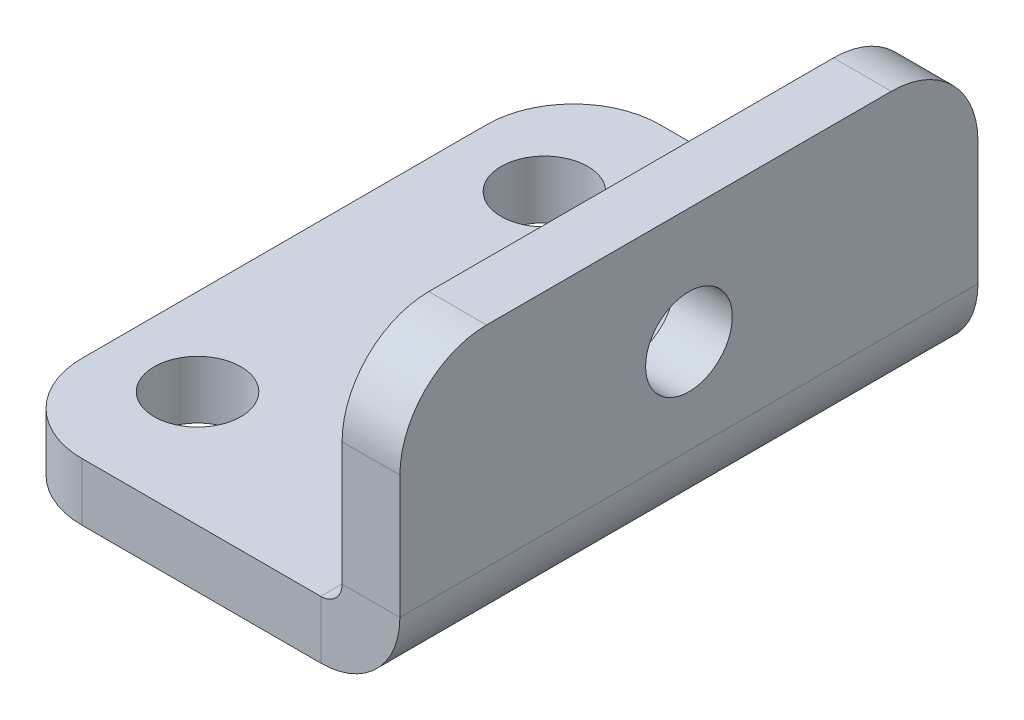
ISO-10303-21;
HEADER;
FILE_DESCRIPTION(('STEP AP214'),'2;1');
FILE_NAME('part.step','',(''),(''),'','','');
FILE_SCHEMA(('AUTOMOTIVE_DESIGN { 1 0 10303 214 1 1 1 1 }'));
ENDSEC;
DATA;
#1=APPLICATION_CONTEXT('core data for automotive mechanical design processes');
#2=APPLICATION_PROTOCOL_DEFINITION('international standard','automotive_design',2000,#1);
#3=PRODUCT_CONTEXT('',#1,'mechanical');
#4=PRODUCT('Part','Part','',(#3));
#5=PRODUCT_RELATED_PRODUCT_CATEGORY('part','',(#4));
#6=PRODUCT_DEFINITION_FORMATION('','',#4);
#7=PRODUCT_DEFINITION_CONTEXT('part definition',#1,'design');
#8=PRODUCT_DEFINITION('design','',#6,#7);
#9=PRODUCT_DEFINITION_SHAPE('','',#8);
#10=(LENGTH_UNIT() NAMED_UNIT(*) SI_UNIT(.MILLI.,.METRE.));
#11=(NAMED_UNIT(*) PLANE_ANGLE_UNIT() SI_UNIT($,.RADIAN.));
#12=(NAMED_UNIT(*) SI_UNIT($,.STERADIAN.) SOLID_ANGLE_UNIT());
#13=UNCERTAINTY_MEASURE_WITH_UNIT(LENGTH_MEASURE(1.E-05),#10,'distance_accuracy_value','');
#14=(GEOMETRIC_REPRESENTATION_CONTEXT(3) GLOBAL_UNCERTAINTY_ASSIGNED_CONTEXT((#13)) GLOBAL_UNIT_ASSIGNED_CONTEXT((#10,
#11,#12)) REPRESENTATION_CONTEXT('',''));
#15=CARTESIAN_POINT('',(0.,0.,0.));
#16=DIRECTION('',(0.,0.,1.));
#17=DIRECTION('',(1.,0.,0.));
#18=AXIS2_PLACEMENT_3D('',#15,#16,#17);
#19=CARTESIAN_POINT('',(0.,0.7366,10.));
#20=DIRECTION('',(0.,0.,1.));
#21=DIRECTION('',(1.,0.,0.));
#22=AXIS2_PLACEMENT_3D('',#19,#20,#21);
#23=PLANE('',#22);
#24=DIRECTION('',(1.,0.,0.));
#25=VECTOR('',#24,1.);
#26=CARTESIAN_POINT('',(0.,0.7366,10.));
#27=LINE('',#26,#25);
#28=CARTESIAN_POINT('',(0.,0.7366,10.));
#29=VERTEX_POINT('',#28);
#30=CARTESIAN_POINT('',(2.,0.7366,10.));
#31=VERTEX_POINT('',#30);
#32=EDGE_CURVE('E140',#29,#31,#27,.T.);
#33=ORIENTED_EDGE('',*,*,#32,.F.);
#34=CARTESIAN_POINT('',(-0.7366,0.7366,10.));
#35=DIRECTION('',(0.,0.,1.));
#36=DIRECTION('',(1.,0.,0.));
#37=AXIS2_PLACEMENT_3D('',#34,#35,#36);
#38=CIRCLE('',#37,0.7366);
#39=CARTESIAN_POINT('',(-0.7366,0.,10.));
#40=VERTEX_POINT('',#39);
#41=EDGE_CURVE('E138',#29,#40,#38,.F.);
#42=ORIENTED_EDGE('',*,*,#41,.T.);
#43=DIRECTION('',(0.,1.,0.));
#44=VECTOR('',#43,1.);
#45=CARTESIAN_POINT('',(-0.7366,-2.,10.));
#46=LINE('',#45,#44);
#47=CARTESIAN_POINT('',(-0.7366,-2.,10.));
#48=VERTEX_POINT('',#47);
#49=EDGE_CURVE('E132',#48,#40,#46,.T.);
#50=ORIENTED_EDGE('',*,*,#49,.F.);
#51=CARTESIAN_POINT('',(-0.7366,0.7366,10.));
#52=DIRECTION('',(0.,0.,1.));
#53=DIRECTION('',(1.,0.,0.));
#54=AXIS2_PLACEMENT_3D('',#51,#52,#53);
#55=CIRCLE('',#54,2.7366);
#56=EDGE_CURVE('E136',#31,#48,#55,.F.);
#57=ORIENTED_EDGE('',*,*,#56,.F.);
#58=EDGE_LOOP('',(#33,#42,#50,#57));
#59=FACE_BOUND('',#58,.T.);
#60=ADVANCED_FACE('F41',(#59),#23,.T.);
#61=CARTESIAN_POINT('',(-0.7366,-2.,10.));
#62=DIRECTION('',(0.,0.,1.));
#63=DIRECTION('',(1.,0.,0.));
#64=AXIS2_PLACEMENT_3D('',#61,#62,#63);
#65=PLANE('',#64);
#66=DIRECTION('',(0.,1.,0.));
#67=VECTOR('',#66,1.);
#68=CARTESIAN_POINT('',(2.,0.,10.));
#69=LINE('',#68,#67);
#70=CARTESIAN_POINT('',(2.,5.,10.));
#71=VERTEX_POINT('',#70);
#72=EDGE_CURVE('E164',#71,#31,#69,.F.);
#73=ORIENTED_EDGE('',*,*,#72,.F.);
#74=DIRECTION('',(1.,0.,0.));
#75=VECTOR('',#74,1.);
#76=CARTESIAN_POINT('',(-0.7366,5.,10.));
#77=LINE('',#76,#75);
#78=CARTESIAN_POINT('',(0.,5.,10.));
#79=VERTEX_POINT('',#78);
#80=EDGE_CURVE('E11',#71,#79,#77,.F.);
#81=ORIENTED_EDGE('',*,*,#80,.T.);
#82=DIRECTION('',(0.,-1.,0.));
#83=VECTOR('',#82,1.);
#84=CARTESIAN_POINT('',(0.,0.,10.));
#85=LINE('',#84,#83);
#86=EDGE_CURVE('E166',#79,#29,#85,.T.);
#87=ORIENTED_EDGE('',*,*,#86,.T.);
#88=ORIENTED_EDGE('',*,*,#32,.T.);
#89=EDGE_LOOP('',(#73,#81,#87,#88));
#90=FACE_BOUND('',#89,.T.);
#91=ADVANCED_FACE('F313',(#90),#65,.T.);
#92=CARTESIAN_POINT('',(-0.7366,0.,-10.));
#93=DIRECTION('',(0.,0.,-1.));
#94=DIRECTION('',(-1.,0.,0.));
#95=AXIS2_PLACEMENT_3D('',#92,#93,#94);
#96=PLANE('',#95);
#97=DIRECTION('',(0.,-1.,0.));
#98=VECTOR('',#97,1.);
#99=CARTESIAN_POINT('',(-0.7366,0.,-10.));
#100=LINE('',#99,#98);
#101=CARTESIAN_POINT('',(-0.7366,0.,-10.));
#102=VERTEX_POINT('',#101);
#103=CARTESIAN_POINT('',(-0.7366,-2.,-10.));
#104=VERTEX_POINT('',#103);
#105=EDGE_CURVE('E141',#102,#104,#100,.T.);
#106=ORIENTED_EDGE('',*,*,#105,.F.);
#107=CARTESIAN_POINT('',(-0.7366,0.7366,-10.));
#108=DIRECTION('',(0.,0.,1.));
#109=DIRECTION('',(1.,0.,0.));
#110=AXIS2_PLACEMENT_3D('',#107,#108,#109);
#111=CIRCLE('',#110,0.7366);
#112=CARTESIAN_POINT('',(0.,0.7366,-10.));
#113=VERTEX_POINT('',#112);
#114=EDGE_CURVE('E184',#113,#102,#111,.F.);
#115=ORIENTED_EDGE('',*,*,#114,.F.);
#116=DIRECTION('',(-1.,0.,0.));
#117=VECTOR('',#116,1.);
#118=CARTESIAN_POINT('',(2.,0.7366,-10.));
#119=LINE('',#118,#117);
#120=CARTESIAN_POINT('',(2.,0.7366,-10.));
#121=VERTEX_POINT('',#120);
#122=EDGE_CURVE('E202',#121,#113,#119,.T.);
#123=ORIENTED_EDGE('',*,*,#122,.F.);
#124=CARTESIAN_POINT('',(-0.7366,0.7366,-10.));
#125=DIRECTION('',(0.,0.,1.));
#126=DIRECTION('',(1.,0.,0.));
#127=AXIS2_PLACEMENT_3D('',#124,#125,#126);
#128=CIRCLE('',#127,2.7366);
#129=EDGE_CURVE('E178',#121,#104,#128,.F.);
#130=ORIENTED_EDGE('',*,*,#129,.T.);
#131=EDGE_LOOP('',(#106,#115,#123,#130));
#132=FACE_BOUND('',#131,.T.);
#133=ADVANCED_FACE('F306',(#132),#96,.T.);
#134=CARTESIAN_POINT('',(2.,0.7366,-10.));
#135=DIRECTION('',(0.,0.,-1.));
#136=DIRECTION('',(-1.,0.,0.));
#137=AXIS2_PLACEMENT_3D('',#134,#135,#136);
#138=PLANE('',#137);
#139=DIRECTION('',(-1.,0.,0.));
#140=VECTOR('',#139,1.);
#141=CARTESIAN_POINT('',(0.,-2.,-10.));
#142=LINE('',#141,#140);
#143=CARTESIAN_POINT('',(-9.,-2.,-10.));
#144=VERTEX_POINT('',#143);
#145=EDGE_CURVE('E151',#104,#144,#142,.T.);
#146=ORIENTED_EDGE('',*,*,#145,.T.);
#147=DIRECTION('',(0.,1.,0.));
#148=VECTOR('',#147,1.);
#149=CARTESIAN_POINT('',(-9.,0.7366,-10.));
#150=LINE('',#149,#148);
#151=CARTESIAN_POINT('',(-9.,0.,-10.));
#152=VERTEX_POINT('',#151);
#153=EDGE_CURVE('E224',#144,#152,#150,.T.);
#154=ORIENTED_EDGE('',*,*,#153,.T.);
#155=DIRECTION('',(-1.,0.,0.));
#156=VECTOR('',#155,1.);
#157=CARTESIAN_POINT('',(0.,0.,-10.));
#158=LINE('',#157,#156);
#159=EDGE_CURVE('E173',#102,#152,#158,.T.);
#160=ORIENTED_EDGE('',*,*,#159,.F.);
#161=ORIENTED_EDGE('',*,*,#105,.T.);
#162=EDGE_LOOP('',(#146,#154,#160,#161));
#163=FACE_BOUND('',#162,.T.);
#164=ADVANCED_FACE('F242',(#163),#138,.T.);
#165=CARTESIAN_POINT('',(0.,0.,10.));
#166=DIRECTION('',(0.,-1.,0.));
#167=DIRECTION('',(1.,0.,0.));
#168=AXIS2_PLACEMENT_3D('',#165,#166,#167);
#169=PLANE('',#168);
#170=CARTESIAN_POINT('',(-9.,0.,-6.));
#171=DIRECTION('',(0.,1.,0.));
#172=DIRECTION('',(-1.,0.,0.));
#173=AXIS2_PLACEMENT_3D('',#170,#171,#172);
#174=CIRCLE('',#173,1.5);
#175=CARTESIAN_POINT('',(-10.5,0.,-6.));
#176=VERTEX_POINT('',#175);
#177=EDGE_CURVE('E261',#176,#176,#174,.T.);
#178=ORIENTED_EDGE('',*,*,#177,.F.);
#179=EDGE_LOOP('',(#178));
#180=FACE_BOUND('',#179,.T.);
#181=CARTESIAN_POINT('',(-9.,0.,6.));
#182=DIRECTION('',(0.,1.,0.));
#183=DIRECTION('',(-1.,0.,0.));
#184=AXIS2_PLACEMENT_3D('',#181,#182,#183);
#185=CIRCLE('',#184,1.5);
#186=CARTESIAN_POINT('',(-10.5,0.,6.));
#187=VERTEX_POINT('',#186);
#188=EDGE_CURVE('E254',#187,#187,#185,.T.);
#189=ORIENTED_EDGE('',*,*,#188,.F.);
#190=EDGE_LOOP('',(#189));
#191=FACE_BOUND('',#190,.T.);
#192=ORIENTED_EDGE('',*,*,#159,.T.);
#193=CARTESIAN_POINT('',(-9.,0.,-7.));
#194=DIRECTION('',(0.,-1.,0.));
#195=DIRECTION('',(1.,0.,0.));
#196=AXIS2_PLACEMENT_3D('',#193,#194,#195);
#197=CIRCLE('',#196,3.);
#198=CARTESIAN_POINT('',(-12.,0.,-7.));
#199=VERTEX_POINT('',#198);
#200=EDGE_CURVE('E229',#152,#199,#197,.F.);
#201=ORIENTED_EDGE('',*,*,#200,.T.);
#202=DIRECTION('',(0.,0.,-1.));
#203=VECTOR('',#202,1.);
#204=CARTESIAN_POINT('',(-12.,0.,10.));
#205=LINE('',#204,#203);
#206=CARTESIAN_POINT('',(-12.,0.,7.));
#207=VERTEX_POINT('',#206);
#208=EDGE_CURVE('E200',#207,#199,#205,.T.);
#209=ORIENTED_EDGE('',*,*,#208,.F.);
#210=CARTESIAN_POINT('',(-9.,0.,7.));
#211=DIRECTION('',(0.,-1.,0.));
#212=DIRECTION('',(1.,0.,0.));
#213=AXIS2_PLACEMENT_3D('',#210,#211,#212);
#214=CIRCLE('',#213,3.);
#215=CARTESIAN_POINT('',(-9.,0.,10.));
#216=VERTEX_POINT('',#215);
#217=EDGE_CURVE('E227',#207,#216,#214,.F.);
#218=ORIENTED_EDGE('',*,*,#217,.T.);
#219=DIRECTION('',(-1.,0.,0.));
#220=VECTOR('',#219,1.);
#221=CARTESIAN_POINT('',(0.,0.,10.));
#222=LINE('',#221,#220);
#223=EDGE_CURVE('E159',#40,#216,#222,.T.);
#224=ORIENTED_EDGE('',*,*,#223,.F.);
#225=DIRECTION('',(0.,0.,-1.));
#226=VECTOR('',#225,1.);
#227=CARTESIAN_POINT('',(-0.7366,0.,10.));
#228=LINE('',#227,#226);
#229=EDGE_CURVE('E172',#40,#102,#228,.T.);
#230=ORIENTED_EDGE('',*,*,#229,.T.);
#231=EDGE_LOOP('',(#192,#201,#209,#218,#224,#230));
#232=FACE_BOUND('',#231,.T.);
#233=ADVANCED_FACE('F247',(#180,#191,#232),#169,.F.);
#234=CARTESIAN_POINT('',(-12.,-2.,10.));
#235=DIRECTION('',(-1.,0.,0.));
#236=DIRECTION('',(0.,0.,1.));
#237=AXIS2_PLACEMENT_3D('',#234,#235,#236);
#238=PLANE('',#237);
#239=ORIENTED_EDGE('',*,*,#208,.T.);
#240=DIRECTION('',(0.,1.,0.));
#241=VECTOR('',#240,1.);
#242=CARTESIAN_POINT('',(-12.,-2.,-7.));
#243=LINE('',#242,#241);
#244=CARTESIAN_POINT('',(-12.,-2.,-7.));
#245=VERTEX_POINT('',#244);
#246=EDGE_CURVE('E63',#199,#245,#243,.F.);
#247=ORIENTED_EDGE('',*,*,#246,.T.);
#248=DIRECTION('',(0.,0.,-1.));
#249=VECTOR('',#248,1.);
#250=CARTESIAN_POINT('',(-12.,-2.,10.));
#251=LINE('',#250,#249);
#252=CARTESIAN_POINT('',(-12.,-2.,7.));
#253=VERTEX_POINT('',#252);
#254=EDGE_CURVE('E155',#253,#245,#251,.T.);
#255=ORIENTED_EDGE('',*,*,#254,.F.);
#256=DIRECTION('',(0.,1.,0.));
#257=VECTOR('',#256,1.);
#258=CARTESIAN_POINT('',(-12.,-2.,7.));
#259=LINE('',#258,#257);
#260=EDGE_CURVE('E231',#253,#207,#259,.T.);
#261=ORIENTED_EDGE('',*,*,#260,.T.);
#262=EDGE_LOOP('',(#239,#247,#255,#261));
#263=FACE_BOUND('',#262,.T.);
#264=ADVANCED_FACE('F248',(#263),#238,.T.);
#265=CARTESIAN_POINT('',(0.,-2.,10.));
#266=DIRECTION('',(0.,-1.,0.));
#267=DIRECTION('',(1.,0.,0.));
#268=AXIS2_PLACEMENT_3D('',#265,#266,#267);
#269=PLANE('',#268);
#270=CARTESIAN_POINT('',(-9.,-2.,-6.));
#271=DIRECTION('',(0.,1.,0.));
#272=DIRECTION('',(-1.,0.,0.));
#273=AXIS2_PLACEMENT_3D('',#270,#271,#272);
#274=CIRCLE('',#273,1.5);
#275=CARTESIAN_POINT('',(-10.5,-2.,-6.));
#276=VERTEX_POINT('',#275);
#277=EDGE_CURVE('E176',#276,#276,#274,.T.);
#278=ORIENTED_EDGE('',*,*,#277,.T.);
#279=EDGE_LOOP('',(#278));
#280=FACE_BOUND('',#279,.T.);
#281=CARTESIAN_POINT('',(-9.,-2.,6.));
#282=DIRECTION('',(0.,1.,0.));
#283=DIRECTION('',(-1.,0.,0.));
#284=AXIS2_PLACEMENT_3D('',#281,#282,#283);
#285=CIRCLE('',#284,1.5);
#286=CARTESIAN_POINT('',(-10.5,-2.,6.));
#287=VERTEX_POINT('',#286);
#288=EDGE_CURVE('E257',#287,#287,#285,.T.);
#289=ORIENTED_EDGE('',*,*,#288,.T.);
#290=EDGE_LOOP('',(#289));
#291=FACE_BOUND('',#290,.T.);
#292=ORIENTED_EDGE('',*,*,#254,.T.);
#293=CARTESIAN_POINT('',(-9.,-2.,-7.));
#294=DIRECTION('',(0.,-1.,0.));
#295=DIRECTION('',(1.,0.,0.));
#296=AXIS2_PLACEMENT_3D('',#293,#294,#295);
#297=CIRCLE('',#296,3.);
#298=EDGE_CURVE('E237',#245,#144,#297,.T.);
#299=ORIENTED_EDGE('',*,*,#298,.T.);
#300=ORIENTED_EDGE('',*,*,#145,.F.);
#301=DIRECTION('',(0.,0.,-1.));
#302=VECTOR('',#301,1.);
#303=CARTESIAN_POINT('',(-0.7366,-2.,10.));
#304=LINE('',#303,#302);
#305=EDGE_CURVE('E146',#48,#104,#304,.T.);
#306=ORIENTED_EDGE('',*,*,#305,.F.);
#307=DIRECTION('',(-1.,0.,0.));
#308=VECTOR('',#307,1.);
#309=CARTESIAN_POINT('',(0.,-2.,10.));
#310=LINE('',#309,#308);
#311=CARTESIAN_POINT('',(-9.,-2.,10.));
#312=VERTEX_POINT('',#311);
#313=EDGE_CURVE('E148',#48,#312,#310,.T.);
#314=ORIENTED_EDGE('',*,*,#313,.T.);
#315=CARTESIAN_POINT('',(-9.,-2.,7.));
#316=DIRECTION('',(0.,-1.,0.));
#317=DIRECTION('',(1.,0.,0.));
#318=AXIS2_PLACEMENT_3D('',#315,#316,#317);
#319=CIRCLE('',#318,3.);
#320=EDGE_CURVE('E235',#312,#253,#319,.T.);
#321=ORIENTED_EDGE('',*,*,#320,.T.);
#322=EDGE_LOOP('',(#292,#299,#300,#306,#314,#321));
#323=FACE_BOUND('',#322,.T.);
#324=ADVANCED_FACE('F147',(#280,#291,#323),#269,.T.);
#325=CARTESIAN_POINT('',(-0.7366,0.7366,10.));
#326=DIRECTION('',(0.,0.,-1.));
#327=DIRECTION('',(-1.,0.,0.));
#328=AXIS2_PLACEMENT_3D('',#325,#326,#327);
#329=CYLINDRICAL_SURFACE('',#328,2.7366);
#330=ORIENTED_EDGE('',*,*,#129,.F.);
#331=DIRECTION('',(0.,0.,-1.));
#332=VECTOR('',#331,1.);
#333=CARTESIAN_POINT('',(2.,0.7366,10.));
#334=LINE('',#333,#332);
#335=EDGE_CURVE('E156',#31,#121,#334,.T.);
#336=ORIENTED_EDGE('',*,*,#335,.F.);
#337=ORIENTED_EDGE('',*,*,#56,.T.);
#338=ORIENTED_EDGE('',*,*,#305,.T.);
#339=EDGE_LOOP('',(#330,#336,#337,#338));
#340=FACE_BOUND('',#339,.T.);
#341=ADVANCED_FACE('F162',(#340),#329,.T.);
#342=CARTESIAN_POINT('',(2.,0.,10.));
#343=DIRECTION('',(1.,0.,0.));
#344=DIRECTION('',(0.,0.,-1.));
#345=AXIS2_PLACEMENT_3D('',#342,#343,#344);
#346=PLANE('',#345);
#347=CARTESIAN_POINT('',(2.,4.,0.));
#348=DIRECTION('',(-1.,0.,0.));
#349=DIRECTION('',(0.,0.,1.));
#350=AXIS2_PLACEMENT_3D('',#347,#348,#349);
#351=CIRCLE('',#350,1.5);
#352=CARTESIAN_POINT('',(2.,4.,1.5));
#353=VERTEX_POINT('',#352);
#354=EDGE_CURVE('E258',#353,#353,#351,.T.);
#355=ORIENTED_EDGE('',*,*,#354,.T.);
#356=EDGE_LOOP('',(#355));
#357=FACE_BOUND('',#356,.T.);
#358=DIRECTION('',(0.,1.,0.));
#359=VECTOR('',#358,1.);
#360=CARTESIAN_POINT('',(2.,0.,-10.));
#361=LINE('',#360,#359);
#362=CARTESIAN_POINT('',(2.,5.,-10.));
#363=VERTEX_POINT('',#362);
#364=EDGE_CURVE('E180',#363,#121,#361,.F.);
#365=ORIENTED_EDGE('',*,*,#364,.F.);
#366=CARTESIAN_POINT('',(2.,5.,-7.));
#367=DIRECTION('',(1.,0.,0.));
#368=DIRECTION('',(0.,0.,-1.));
#369=AXIS2_PLACEMENT_3D('',#366,#367,#368);
#370=CIRCLE('',#369,3.);
#371=CARTESIAN_POINT('',(2.,8.,-7.));
#372=VERTEX_POINT('',#371);
#373=EDGE_CURVE('E213',#363,#372,#370,.T.);
#374=ORIENTED_EDGE('',*,*,#373,.T.);
#375=DIRECTION('',(0.,0.,-1.));
#376=VECTOR('',#375,1.);
#377=CARTESIAN_POINT('',(2.,8.,10.));
#378=LINE('',#377,#376);
#379=CARTESIAN_POINT('',(2.,8.,7.));
#380=VERTEX_POINT('',#379);
#381=EDGE_CURVE('E195',#380,#372,#378,.T.);
#382=ORIENTED_EDGE('',*,*,#381,.F.);
#383=CARTESIAN_POINT('',(2.,5.,7.));
#384=DIRECTION('',(1.,0.,0.));
#385=DIRECTION('',(0.,0.,-1.));
#386=AXIS2_PLACEMENT_3D('',#383,#384,#385);
#387=CIRCLE('',#386,3.);
#388=EDGE_CURVE('E211',#380,#71,#387,.T.);
#389=ORIENTED_EDGE('',*,*,#388,.T.);
#390=ORIENTED_EDGE('',*,*,#72,.T.);
#391=ORIENTED_EDGE('',*,*,#335,.T.);
#392=EDGE_LOOP('',(#365,#374,#382,#389,#390,#391));
#393=FACE_BOUND('',#392,.T.);
#394=ADVANCED_FACE('F272',(#357,#393),#346,.T.);
#395=CARTESIAN_POINT('',(0.,8.,10.));
#396=DIRECTION('',(0.,1.,0.));
#397=DIRECTION('',(0.,0.,1.));
#398=AXIS2_PLACEMENT_3D('',#395,#396,#397);
#399=PLANE('',#398);
#400=ORIENTED_EDGE('',*,*,#381,.T.);
#401=DIRECTION('',(1.,0.,0.));
#402=VECTOR('',#401,1.);
#403=CARTESIAN_POINT('',(0.,8.,-7.));
#404=LINE('',#403,#402);
#405=CARTESIAN_POINT('',(0.,8.,-7.));
#406=VERTEX_POINT('',#405);
#407=EDGE_CURVE('E218',#372,#406,#404,.F.);
#408=ORIENTED_EDGE('',*,*,#407,.T.);
#409=DIRECTION('',(0.,0.,-1.));
#410=VECTOR('',#409,1.);
#411=CARTESIAN_POINT('',(0.,8.,10.));
#412=LINE('',#411,#410);
#413=CARTESIAN_POINT('',(0.,8.,7.));
#414=VERTEX_POINT('',#413);
#415=EDGE_CURVE('E192',#414,#406,#412,.T.);
#416=ORIENTED_EDGE('',*,*,#415,.F.);
#417=DIRECTION('',(1.,0.,0.));
#418=VECTOR('',#417,1.);
#419=CARTESIAN_POINT('',(0.,8.,7.));
#420=LINE('',#419,#418);
#421=EDGE_CURVE('E215',#414,#380,#420,.T.);
#422=ORIENTED_EDGE('',*,*,#421,.T.);
#423=EDGE_LOOP('',(#400,#408,#416,#422));
#424=FACE_BOUND('',#423,.T.);
#425=ADVANCED_FACE('F286',(#424),#399,.T.);
#426=CARTESIAN_POINT('',(0.,0.,10.));
#427=DIRECTION('',(1.,0.,0.));
#428=DIRECTION('',(0.,0.,-1.));
#429=AXIS2_PLACEMENT_3D('',#426,#427,#428);
#430=PLANE('',#429);
#431=CARTESIAN_POINT('',(0.,4.,0.));
#432=DIRECTION('',(-1.,0.,0.));
#433=DIRECTION('',(0.,0.,1.));
#434=AXIS2_PLACEMENT_3D('',#431,#432,#433);
#435=CIRCLE('',#434,1.5);
#436=CARTESIAN_POINT('',(0.,4.,1.5));
#437=VERTEX_POINT('',#436);
#438=EDGE_CURVE('E266',#437,#437,#435,.T.);
#439=ORIENTED_EDGE('',*,*,#438,.F.);
#440=EDGE_LOOP('',(#439));
#441=FACE_BOUND('',#440,.T.);
#442=ORIENTED_EDGE('',*,*,#415,.T.);
#443=CARTESIAN_POINT('',(0.,5.,-7.));
#444=DIRECTION('',(1.,0.,0.));
#445=DIRECTION('',(0.,0.,-1.));
#446=AXIS2_PLACEMENT_3D('',#443,#444,#445);
#447=CIRCLE('',#446,3.);
#448=CARTESIAN_POINT('',(0.,5.,-10.));
#449=VERTEX_POINT('',#448);
#450=EDGE_CURVE('E222',#406,#449,#447,.F.);
#451=ORIENTED_EDGE('',*,*,#450,.T.);
#452=DIRECTION('',(0.,-1.,0.));
#453=VECTOR('',#452,1.);
#454=CARTESIAN_POINT('',(0.,0.,-10.));
#455=LINE('',#454,#453);
#456=EDGE_CURVE('E182',#449,#113,#455,.T.);
#457=ORIENTED_EDGE('',*,*,#456,.T.);
#458=DIRECTION('',(0.,0.,-1.));
#459=VECTOR('',#458,1.);
#460=CARTESIAN_POINT('',(0.,0.7366,10.));
#461=LINE('',#460,#459);
#462=EDGE_CURVE('E189',#29,#113,#461,.T.);
#463=ORIENTED_EDGE('',*,*,#462,.F.);
#464=ORIENTED_EDGE('',*,*,#86,.F.);
#465=CARTESIAN_POINT('',(0.,5.,7.));
#466=DIRECTION('',(1.,0.,0.));
#467=DIRECTION('',(0.,0.,-1.));
#468=AXIS2_PLACEMENT_3D('',#465,#466,#467);
#469=CIRCLE('',#468,3.);
#470=EDGE_CURVE('E220',#79,#414,#469,.F.);
#471=ORIENTED_EDGE('',*,*,#470,.T.);
#472=EDGE_LOOP('',(#442,#451,#457,#463,#464,#471));
#473=FACE_BOUND('',#472,.T.);
#474=ADVANCED_FACE('F282',(#441,#473),#430,.F.);
#475=CARTESIAN_POINT('',(-0.7366,0.7366,10.));
#476=DIRECTION('',(0.,0.,-1.));
#477=DIRECTION('',(-1.,0.,0.));
#478=AXIS2_PLACEMENT_3D('',#475,#476,#477);
#479=CYLINDRICAL_SURFACE('',#478,0.7366);
#480=ORIENTED_EDGE('',*,*,#114,.T.);
#481=ORIENTED_EDGE('',*,*,#229,.F.);
#482=ORIENTED_EDGE('',*,*,#41,.F.);
#483=ORIENTED_EDGE('',*,*,#462,.T.);
#484=EDGE_LOOP('',(#480,#481,#482,#483));
#485=FACE_BOUND('',#484,.T.);
#486=ADVANCED_FACE('F285',(#485),#479,.F.);
#487=CARTESIAN_POINT('',(-0.7366,0.7366,10.));
#488=DIRECTION('',(0.,0.,1.));
#489=DIRECTION('',(1.,0.,0.));
#490=AXIS2_PLACEMENT_3D('',#487,#488,#489);
#491=PLANE('',#490);
#492=ORIENTED_EDGE('',*,*,#223,.T.);
#493=DIRECTION('',(0.,1.,0.));
#494=VECTOR('',#493,1.);
#495=CARTESIAN_POINT('',(-9.,0.7366,10.));
#496=LINE('',#495,#494);
#497=EDGE_CURVE('E49',#216,#312,#496,.F.);
#498=ORIENTED_EDGE('',*,*,#497,.T.);
#499=ORIENTED_EDGE('',*,*,#313,.F.);
#500=ORIENTED_EDGE('',*,*,#49,.T.);
#501=EDGE_LOOP('',(#492,#498,#499,#500));
#502=FACE_BOUND('',#501,.T.);
#503=ADVANCED_FACE('F158',(#502),#491,.T.);
#504=CARTESIAN_POINT('',(-0.7366,0.7366,-10.));
#505=DIRECTION('',(0.,0.,1.));
#506=DIRECTION('',(1.,0.,0.));
#507=AXIS2_PLACEMENT_3D('',#504,#505,#506);
#508=PLANE('',#507);
#509=ORIENTED_EDGE('',*,*,#456,.F.);
#510=DIRECTION('',(1.,0.,0.));
#511=VECTOR('',#510,1.);
#512=CARTESIAN_POINT('',(2.,5.,-10.));
#513=LINE('',#512,#511);
#514=EDGE_CURVE('E208',#449,#363,#513,.T.);
#515=ORIENTED_EDGE('',*,*,#514,.T.);
#516=ORIENTED_EDGE('',*,*,#364,.T.);
#517=ORIENTED_EDGE('',*,*,#122,.T.);
#518=EDGE_LOOP('',(#509,#515,#516,#517));
#519=FACE_BOUND('',#518,.T.);
#520=ADVANCED_FACE('F301',(#519),#508,.F.);
#521=CARTESIAN_POINT('',(-0.7366,5.,-7.));
#522=DIRECTION('',(-1.,0.,0.));
#523=DIRECTION('',(0.,0.,1.));
#524=AXIS2_PLACEMENT_3D('',#521,#522,#523);
#525=CYLINDRICAL_SURFACE('',#524,3.);
#526=ORIENTED_EDGE('',*,*,#450,.F.);
#527=ORIENTED_EDGE('',*,*,#407,.F.);
#528=ORIENTED_EDGE('',*,*,#373,.F.);
#529=ORIENTED_EDGE('',*,*,#514,.F.);
#530=EDGE_LOOP('',(#526,#527,#528,#529));
#531=FACE_BOUND('',#530,.T.);
#532=ADVANCED_FACE('F298',(#531),#525,.T.);
#533=CARTESIAN_POINT('',(-9.,0.7366,-7.));
#534=DIRECTION('',(0.,1.,0.));
#535=DIRECTION('',(0.,0.,1.));
#536=AXIS2_PLACEMENT_3D('',#533,#534,#535);
#537=CYLINDRICAL_SURFACE('',#536,3.);
#538=ORIENTED_EDGE('',*,*,#298,.F.);
#539=ORIENTED_EDGE('',*,*,#246,.F.);
#540=ORIENTED_EDGE('',*,*,#200,.F.);
#541=ORIENTED_EDGE('',*,*,#153,.F.);
#542=EDGE_LOOP('',(#538,#539,#540,#541));
#543=FACE_BOUND('',#542,.T.);
#544=ADVANCED_FACE('F244',(#543),#537,.T.);
#545=CARTESIAN_POINT('',(-9.,-2.,7.));
#546=DIRECTION('',(0.,1.,0.));
#547=DIRECTION('',(0.,0.,1.));
#548=AXIS2_PLACEMENT_3D('',#545,#546,#547);
#549=CYLINDRICAL_SURFACE('',#548,3.);
#550=ORIENTED_EDGE('',*,*,#320,.F.);
#551=ORIENTED_EDGE('',*,*,#497,.F.);
#552=ORIENTED_EDGE('',*,*,#217,.F.);
#553=ORIENTED_EDGE('',*,*,#260,.F.);
#554=EDGE_LOOP('',(#550,#551,#552,#553));
#555=FACE_BOUND('',#554,.T.);
#556=ADVANCED_FACE('F251',(#555),#549,.T.);
#557=CARTESIAN_POINT('',(0.,5.,7.));
#558=DIRECTION('',(1.,0.,0.));
#559=DIRECTION('',(0.,0.,-1.));
#560=AXIS2_PLACEMENT_3D('',#557,#558,#559);
#561=CYLINDRICAL_SURFACE('',#560,3.);
#562=ORIENTED_EDGE('',*,*,#470,.F.);
#563=ORIENTED_EDGE('',*,*,#80,.F.);
#564=ORIENTED_EDGE('',*,*,#388,.F.);
#565=ORIENTED_EDGE('',*,*,#421,.F.);
#566=EDGE_LOOP('',(#562,#563,#564,#565));
#567=FACE_BOUND('',#566,.T.);
#568=ADVANCED_FACE('F43',(#567),#561,.T.);
#569=CARTESIAN_POINT('',(-9.,-2.,6.));
#570=DIRECTION('',(0.,1.,0.));
#571=DIRECTION('',(-1.,0.,0.));
#572=AXIS2_PLACEMENT_3D('',#569,#570,#571);
#573=CYLINDRICAL_SURFACE('',#572,1.5);
#574=ORIENTED_EDGE('',*,*,#288,.F.);
#575=EDGE_LOOP('',(#574));
#576=FACE_BOUND('',#575,.T.);
#577=ORIENTED_EDGE('',*,*,#188,.T.);
#578=EDGE_LOOP('',(#577));
#579=FACE_BOUND('',#578,.T.);
#580=ADVANCED_FACE('F331',(#576,#579),#573,.F.);
#581=CARTESIAN_POINT('',(-9.,-2.,-6.));
#582=DIRECTION('',(0.,1.,0.));
#583=DIRECTION('',(-1.,0.,0.));
#584=AXIS2_PLACEMENT_3D('',#581,#582,#583);
#585=CYLINDRICAL_SURFACE('',#584,1.5);
#586=ORIENTED_EDGE('',*,*,#277,.F.);
#587=EDGE_LOOP('',(#586));
#588=FACE_BOUND('',#587,.T.);
#589=ORIENTED_EDGE('',*,*,#177,.T.);
#590=EDGE_LOOP('',(#589));
#591=FACE_BOUND('',#590,.T.);
#592=ADVANCED_FACE('F278',(#588,#591),#585,.F.);
#593=CARTESIAN_POINT('',(2.,4.,0.));
#594=DIRECTION('',(-1.,0.,0.));
#595=DIRECTION('',(0.,0.,1.));
#596=AXIS2_PLACEMENT_3D('',#593,#594,#595);
#597=CYLINDRICAL_SURFACE('',#596,1.5);
#598=ORIENTED_EDGE('',*,*,#354,.F.);
#599=EDGE_LOOP('',(#598));
#600=FACE_BOUND('',#599,.T.);
#601=ORIENTED_EDGE('',*,*,#438,.T.);
#602=EDGE_LOOP('',(#601));
#603=FACE_BOUND('',#602,.T.);
#604=ADVANCED_FACE('F275',(#600,#603),#597,.F.);
#605=CLOSED_SHELL('',(#60,#91,#133,#164,#233,#264,#324,#341,#394,#425,#474,#486,#503,#520,#532,
#544,#556,#568,#580,#592,#604));
#606=MANIFOLD_SOLID_BREP('B2',#605);
#607=ADVANCED_BREP_SHAPE_REPRESENTATION('',(#18,#606),#14);
#608=SHAPE_DEFINITION_REPRESENTATION(#9,#607);
ENDSEC;
END-ISO-10303-21;
